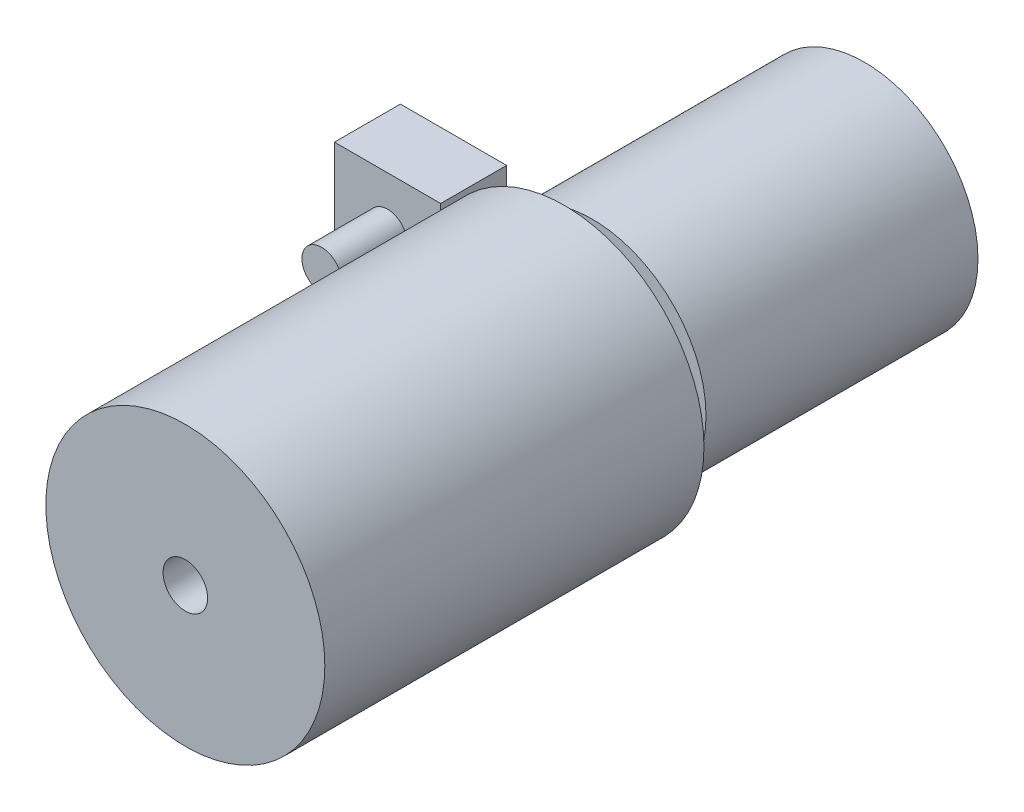
ISO-10303-21;
HEADER;
FILE_DESCRIPTION(('STEP AP214'),'2;1');
FILE_NAME('part.step','',(''),(''),'','','');
FILE_SCHEMA(('AUTOMOTIVE_DESIGN { 1 0 10303 214 1 1 1 1 }'));
ENDSEC;
DATA;
#1=APPLICATION_CONTEXT('core data for automotive mechanical design processes');
#2=APPLICATION_PROTOCOL_DEFINITION('international standard','automotive_design',2000,#1);
#3=PRODUCT_CONTEXT('',#1,'mechanical');
#4=PRODUCT('Part','Part','',(#3));
#5=PRODUCT_RELATED_PRODUCT_CATEGORY('part','',(#4));
#6=PRODUCT_DEFINITION_FORMATION('','',#4);
#7=PRODUCT_DEFINITION_CONTEXT('part definition',#1,'design');
#8=PRODUCT_DEFINITION('design','',#6,#7);
#9=PRODUCT_DEFINITION_SHAPE('','',#8);
#10=(LENGTH_UNIT() NAMED_UNIT(*) SI_UNIT(.MILLI.,.METRE.));
#11=(NAMED_UNIT(*) PLANE_ANGLE_UNIT() SI_UNIT($,.RADIAN.));
#12=(NAMED_UNIT(*) SI_UNIT($,.STERADIAN.) SOLID_ANGLE_UNIT());
#13=UNCERTAINTY_MEASURE_WITH_UNIT(LENGTH_MEASURE(1.E-05),#10,'distance_accuracy_value','');
#14=(GEOMETRIC_REPRESENTATION_CONTEXT(3) GLOBAL_UNCERTAINTY_ASSIGNED_CONTEXT((#13)) GLOBAL_UNIT_ASSIGNED_CONTEXT((#10,
#11,#12)) REPRESENTATION_CONTEXT('',''));
#15=CARTESIAN_POINT('',(0.,0.,0.));
#16=DIRECTION('',(0.,0.,1.));
#17=DIRECTION('',(1.,0.,0.));
#18=AXIS2_PLACEMENT_3D('',#15,#16,#17);
#19=CARTESIAN_POINT('',(0.,0.,82.4011594679737));
#20=DIRECTION('',(0.,0.,1.));
#21=DIRECTION('',(1.,0.,0.));
#22=AXIS2_PLACEMENT_3D('',#19,#20,#21);
#23=PLANE('',#22);
#24=CARTESIAN_POINT('',(0.,0.,82.4011594679737));
#25=DIRECTION('',(0.,0.,1.));
#26=DIRECTION('',(1.,0.,0.));
#27=AXIS2_PLACEMENT_3D('',#24,#25,#26);
#28=CIRCLE('',#27,16.9246045699818);
#29=CARTESIAN_POINT('',(16.9246045699818,0.,82.4011594679737));
#30=VERTEX_POINT('',#29);
#31=EDGE_CURVE('E12',#30,#30,#28,.T.);
#32=ORIENTED_EDGE('',*,*,#31,.T.);
#33=EDGE_LOOP('',(#32));
#34=FACE_BOUND('',#33,.T.);
#35=CARTESIAN_POINT('',(0.,0.,82.4011594679737));
#36=DIRECTION('',(0.,0.,1.));
#37=DIRECTION('',(1.,0.,0.));
#38=AXIS2_PLACEMENT_3D('',#35,#36,#37);
#39=CIRCLE('',#38,2.7046062);
#40=CARTESIAN_POINT('',(2.7046062,0.,82.4011594679737));
#41=VERTEX_POINT('',#40);
#42=EDGE_CURVE('E65',#41,#41,#39,.T.);
#43=ORIENTED_EDGE('',*,*,#42,.F.);
#44=EDGE_LOOP('',(#43));
#45=FACE_BOUND('',#44,.T.);
#46=ADVANCED_FACE('F54',(#34,#45),#23,.T.);
#47=CARTESIAN_POINT('',(0.,0.,36.4011594679737));
#48=DIRECTION('',(0.,0.,1.));
#49=DIRECTION('',(1.,0.,0.));
#50=AXIS2_PLACEMENT_3D('',#47,#48,#49);
#51=PLANE('',#50);
#52=CARTESIAN_POINT('',(0.,0.,36.4011594679737));
#53=DIRECTION('',(0.,0.,1.));
#54=DIRECTION('',(1.,0.,0.));
#55=AXIS2_PLACEMENT_3D('',#52,#53,#54);
#56=CIRCLE('',#55,16.9246045699818);
#57=CARTESIAN_POINT('',(16.9246045699818,0.,36.4011594679737));
#58=VERTEX_POINT('',#57);
#59=EDGE_CURVE('E58',#58,#58,#56,.T.);
#60=ORIENTED_EDGE('',*,*,#59,.F.);
#61=EDGE_LOOP('',(#60));
#62=FACE_BOUND('',#61,.T.);
#63=CARTESIAN_POINT('',(0.,0.,36.4011594679737));
#64=DIRECTION('',(0.,0.,1.));
#65=DIRECTION('',(1.,0.,0.));
#66=AXIS2_PLACEMENT_3D('',#63,#64,#65);
#67=CIRCLE('',#66,2.7046062);
#68=CARTESIAN_POINT('',(2.7046062,0.,36.4011594679737));
#69=VERTEX_POINT('',#68);
#70=EDGE_CURVE('E67',#69,#69,#67,.T.);
#71=ORIENTED_EDGE('',*,*,#70,.T.);
#72=EDGE_LOOP('',(#71));
#73=FACE_BOUND('',#72,.T.);
#74=ADVANCED_FACE('F77',(#62,#73),#51,.F.);
#75=CARTESIAN_POINT('',(0.,0.,82.4011594679737));
#76=DIRECTION('',(0.,0.,-1.));
#77=DIRECTION('',(-1.,0.,0.));
#78=AXIS2_PLACEMENT_3D('',#75,#76,#77);
#79=CYLINDRICAL_SURFACE('',#78,16.9246045699818);
#80=ORIENTED_EDGE('',*,*,#31,.F.);
#81=EDGE_LOOP('',(#80));
#82=FACE_BOUND('',#81,.T.);
#83=ORIENTED_EDGE('',*,*,#59,.T.);
#84=EDGE_LOOP('',(#83));
#85=FACE_BOUND('',#84,.T.);
#86=ADVANCED_FACE('F56',(#82,#85),#79,.T.);
#87=CARTESIAN_POINT('',(0.,0.,82.4011594679737));
#88=DIRECTION('',(0.,0.,-1.));
#89=DIRECTION('',(-1.,0.,0.));
#90=AXIS2_PLACEMENT_3D('',#87,#88,#89);
#91=CYLINDRICAL_SURFACE('',#90,2.7046062);
#92=ORIENTED_EDGE('',*,*,#42,.T.);
#93=EDGE_LOOP('',(#92));
#94=FACE_BOUND('',#93,.T.);
#95=ORIENTED_EDGE('',*,*,#70,.F.);
#96=EDGE_LOOP('',(#95));
#97=FACE_BOUND('',#96,.T.);
#98=ADVANCED_FACE('F73',(#94,#97),#91,.F.);
#99=CLOSED_SHELL('',(#46,#74,#86,#98));
#100=MANIFOLD_SOLID_BREP('B2',#99);
#101=CARTESIAN_POINT('',(-24.8647244854965,0.,41.));
#102=DIRECTION('',(0.,0.,-1.));
#103=DIRECTION('',(-1.,0.,0.));
#104=AXIS2_PLACEMENT_3D('',#101,#102,#103);
#105=CYLINDRICAL_SURFACE('',#104,2.39175593570654);
#106=CARTESIAN_POINT('',(-24.8647244854965,0.,41.));
#107=DIRECTION('',(0.,0.,1.));
#108=DIRECTION('',(1.,0.,0.));
#109=AXIS2_PLACEMENT_3D('',#106,#107,#108);
#110=CIRCLE('',#109,2.39175593570654);
#111=CARTESIAN_POINT('',(-22.4729685497899,0.,41.));
#112=VERTEX_POINT('',#111);
#113=EDGE_CURVE('E52',#112,#112,#110,.T.);
#114=ORIENTED_EDGE('',*,*,#113,.F.);
#115=EDGE_LOOP('',(#114));
#116=FACE_BOUND('',#115,.T.);
#117=CARTESIAN_POINT('',(-24.8647244854965,0.,33.));
#118=DIRECTION('',(0.,0.,1.));
#119=DIRECTION('',(1.,0.,0.));
#120=AXIS2_PLACEMENT_3D('',#117,#118,#119);
#121=CIRCLE('',#120,2.39175593570654);
#122=CARTESIAN_POINT('',(-22.4729685497899,0.,33.));
#123=VERTEX_POINT('',#122);
#124=EDGE_CURVE('E126',#123,#123,#121,.T.);
#125=ORIENTED_EDGE('',*,*,#124,.T.);
#126=EDGE_LOOP('',(#125));
#127=FACE_BOUND('',#126,.T.);
#128=ADVANCED_FACE('F123',(#116,#127),#105,.T.);
#129=CARTESIAN_POINT('',(0.,0.,41.));
#130=DIRECTION('',(0.,0.,1.));
#131=DIRECTION('',(1.,0.,0.));
#132=AXIS2_PLACEMENT_3D('',#129,#130,#131);
#133=PLANE('',#132);
#134=ORIENTED_EDGE('',*,*,#113,.T.);
#135=EDGE_LOOP('',(#134));
#136=FACE_BOUND('',#135,.T.);
#137=ADVANCED_FACE('F219',(#136),#133,.T.);
#138=CARTESIAN_POINT('',(-31.3070832551148,-6.21381259878717,25.));
#139=DIRECTION('',(1.,0.,0.));
#140=DIRECTION('',(0.,0.,-1.));
#141=AXIS2_PLACEMENT_3D('',#138,#139,#140);
#142=PLANE('',#141);
#143=DIRECTION('',(0.,1.,0.));
#144=VECTOR('',#143,1.);
#145=CARTESIAN_POINT('',(-31.3070832551148,-6.21381259878717,33.));
#146=LINE('',#145,#144);
#147=CARTESIAN_POINT('',(-31.3070832551148,-6.21381259878717,33.));
#148=VERTEX_POINT('',#147);
#149=CARTESIAN_POINT('',(-31.3070832551148,6.21381259878717,33.));
#150=VERTEX_POINT('',#149);
#151=EDGE_CURVE('E190',#148,#150,#146,.T.);
#152=ORIENTED_EDGE('',*,*,#151,.T.);
#153=DIRECTION('',(0.,0.,1.));
#154=VECTOR('',#153,1.);
#155=CARTESIAN_POINT('',(-31.3070832551148,6.21381259878717,25.));
#156=LINE('',#155,#154);
#157=CARTESIAN_POINT('',(-31.3070832551148,6.21381259878717,25.));
#158=VERTEX_POINT('',#157);
#159=EDGE_CURVE('E181',#158,#150,#156,.T.);
#160=ORIENTED_EDGE('',*,*,#159,.F.);
#161=DIRECTION('',(0.,1.,0.));
#162=VECTOR('',#161,1.);
#163=CARTESIAN_POINT('',(-31.3070832551148,-6.21381259878717,25.));
#164=LINE('',#163,#162);
#165=CARTESIAN_POINT('',(-31.3070832551148,-6.21381259878717,25.));
#166=VERTEX_POINT('',#165);
#167=EDGE_CURVE('E175',#166,#158,#164,.T.);
#168=ORIENTED_EDGE('',*,*,#167,.F.);
#169=DIRECTION('',(0.,0.,1.));
#170=VECTOR('',#169,1.);
#171=CARTESIAN_POINT('',(-31.3070832551148,-6.21381259878717,25.));
#172=LINE('',#171,#170);
#173=EDGE_CURVE('E186',#166,#148,#172,.T.);
#174=ORIENTED_EDGE('',*,*,#173,.T.);
#175=EDGE_LOOP('',(#152,#160,#168,#174));
#176=FACE_BOUND('',#175,.T.);
#177=ADVANCED_FACE('F208',(#176),#142,.F.);
#178=CARTESIAN_POINT('',(-18.4223657158782,6.21381259878717,25.));
#179=DIRECTION('',(0.,-1.,0.));
#180=DIRECTION('',(0.,0.,-1.));
#181=AXIS2_PLACEMENT_3D('',#178,#179,#180);
#182=PLANE('',#181);
#183=DIRECTION('',(1.,0.,0.));
#184=VECTOR('',#183,1.);
#185=CARTESIAN_POINT('',(-18.4223657158782,6.21381259878717,33.));
#186=LINE('',#185,#184);
#187=CARTESIAN_POINT('',(-18.4223657158782,6.21381259878717,33.));
#188=VERTEX_POINT('',#187);
#189=EDGE_CURVE('E180',#150,#188,#186,.T.);
#190=ORIENTED_EDGE('',*,*,#189,.T.);
#191=DIRECTION('',(0.,0.,1.));
#192=VECTOR('',#191,1.);
#193=CARTESIAN_POINT('',(-18.4223657158782,6.21381259878717,25.));
#194=LINE('',#193,#192);
#195=CARTESIAN_POINT('',(-18.4223657158782,6.21381259878717,25.));
#196=VERTEX_POINT('',#195);
#197=EDGE_CURVE('E178',#196,#188,#194,.T.);
#198=ORIENTED_EDGE('',*,*,#197,.F.);
#199=DIRECTION('',(1.,0.,0.));
#200=VECTOR('',#199,1.);
#201=CARTESIAN_POINT('',(-18.4223657158782,6.21381259878717,25.));
#202=LINE('',#201,#200);
#203=EDGE_CURVE('E170',#158,#196,#202,.T.);
#204=ORIENTED_EDGE('',*,*,#203,.F.);
#205=ORIENTED_EDGE('',*,*,#159,.T.);
#206=EDGE_LOOP('',(#190,#198,#204,#205));
#207=FACE_BOUND('',#206,.T.);
#208=ADVANCED_FACE('F179',(#207),#182,.F.);
#209=CARTESIAN_POINT('',(-18.4223657158782,-6.21381259878717,25.));
#210=DIRECTION('',(-1.,0.,0.));
#211=DIRECTION('',(0.,0.,1.));
#212=AXIS2_PLACEMENT_3D('',#209,#210,#211);
#213=PLANE('',#212);
#214=DIRECTION('',(0.,-1.,0.));
#215=VECTOR('',#214,1.);
#216=CARTESIAN_POINT('',(-18.4223657158782,-6.21381259878717,33.));
#217=LINE('',#216,#215);
#218=CARTESIAN_POINT('',(-18.4223657158782,-6.21381259878717,33.));
#219=VERTEX_POINT('',#218);
#220=EDGE_CURVE('E156',#188,#219,#217,.T.);
#221=ORIENTED_EDGE('',*,*,#220,.T.);
#222=DIRECTION('',(0.,0.,1.));
#223=VECTOR('',#222,1.);
#224=CARTESIAN_POINT('',(-18.4223657158782,-6.21381259878717,25.));
#225=LINE('',#224,#223);
#226=CARTESIAN_POINT('',(-18.4223657158782,-6.21381259878717,25.));
#227=VERTEX_POINT('',#226);
#228=EDGE_CURVE('E182',#227,#219,#225,.T.);
#229=ORIENTED_EDGE('',*,*,#228,.F.);
#230=DIRECTION('',(0.,-1.,0.));
#231=VECTOR('',#230,1.);
#232=CARTESIAN_POINT('',(-18.4223657158782,-6.21381259878717,25.));
#233=LINE('',#232,#231);
#234=EDGE_CURVE('E173',#196,#227,#233,.T.);
#235=ORIENTED_EDGE('',*,*,#234,.F.);
#236=ORIENTED_EDGE('',*,*,#197,.T.);
#237=EDGE_LOOP('',(#221,#229,#235,#236));
#238=FACE_BOUND('',#237,.T.);
#239=ADVANCED_FACE('F184',(#238),#213,.F.);
#240=CARTESIAN_POINT('',(-18.4223657158782,-6.21381259878717,25.));
#241=DIRECTION('',(0.,1.,0.));
#242=DIRECTION('',(0.,0.,1.));
#243=AXIS2_PLACEMENT_3D('',#240,#241,#242);
#244=PLANE('',#243);
#245=DIRECTION('',(-1.,0.,0.));
#246=VECTOR('',#245,1.);
#247=CARTESIAN_POINT('',(-18.4223657158782,-6.21381259878717,33.));
#248=LINE('',#247,#246);
#249=EDGE_CURVE('E162',#219,#148,#248,.T.);
#250=ORIENTED_EDGE('',*,*,#249,.T.);
#251=ORIENTED_EDGE('',*,*,#173,.F.);
#252=DIRECTION('',(-1.,0.,0.));
#253=VECTOR('',#252,1.);
#254=CARTESIAN_POINT('',(-18.4223657158782,-6.21381259878717,25.));
#255=LINE('',#254,#253);
#256=EDGE_CURVE('E139',#227,#166,#255,.T.);
#257=ORIENTED_EDGE('',*,*,#256,.F.);
#258=ORIENTED_EDGE('',*,*,#228,.T.);
#259=EDGE_LOOP('',(#250,#251,#257,#258));
#260=FACE_BOUND('',#259,.T.);
#261=ADVANCED_FACE('F209',(#260),#244,.F.);
#262=CARTESIAN_POINT('',(0.,0.,25.));
#263=DIRECTION('',(0.,0.,1.));
#264=DIRECTION('',(1.,0.,0.));
#265=AXIS2_PLACEMENT_3D('',#262,#263,#264);
#266=PLANE('',#265);
#267=ORIENTED_EDGE('',*,*,#167,.T.);
#268=ORIENTED_EDGE('',*,*,#203,.T.);
#269=ORIENTED_EDGE('',*,*,#234,.T.);
#270=ORIENTED_EDGE('',*,*,#256,.T.);
#271=EDGE_LOOP('',(#267,#268,#269,#270));
#272=FACE_BOUND('',#271,.T.);
#273=ADVANCED_FACE('F171',(#272),#266,.F.);
#274=CARTESIAN_POINT('',(0.,0.,33.));
#275=DIRECTION('',(0.,0.,1.));
#276=DIRECTION('',(1.,0.,0.));
#277=AXIS2_PLACEMENT_3D('',#274,#275,#276);
#278=PLANE('',#277);
#279=ORIENTED_EDGE('',*,*,#124,.F.);
#280=EDGE_LOOP('',(#279));
#281=FACE_BOUND('',#280,.T.);
#282=ORIENTED_EDGE('',*,*,#151,.F.);
#283=ORIENTED_EDGE('',*,*,#249,.F.);
#284=ORIENTED_EDGE('',*,*,#220,.F.);
#285=ORIENTED_EDGE('',*,*,#189,.F.);
#286=EDGE_LOOP('',(#282,#283,#284,#285));
#287=FACE_BOUND('',#286,.T.);
#288=ADVANCED_FACE('F202',(#281,#287),#278,.T.);
#289=CLOSED_SHELL('',(#128,#137,#177,#208,#239,#261,#273,#288));
#290=MANIFOLD_SOLID_BREP('B7',#289);
#291=CARTESIAN_POINT('',(0.,0.,33.));
#292=DIRECTION('',(0.,0.,-1.));
#293=DIRECTION('',(-1.,0.,0.));
#294=AXIS2_PLACEMENT_3D('',#291,#292,#293);
#295=CYLINDRICAL_SURFACE('',#294,13.7713116662806);
#296=CARTESIAN_POINT('',(0.,0.,33.));
#297=DIRECTION('',(0.,0.,1.));
#298=DIRECTION('',(1.,0.,0.));
#299=AXIS2_PLACEMENT_3D('',#296,#297,#298);
#300=CIRCLE('',#299,13.7713116662806);
#301=CARTESIAN_POINT('',(13.7713116662806,0.,33.));
#302=VERTEX_POINT('',#301);
#303=EDGE_CURVE('E284',#302,#302,#300,.T.);
#304=ORIENTED_EDGE('',*,*,#303,.F.);
#305=EDGE_LOOP('',(#304));
#306=FACE_BOUND('',#305,.T.);
#307=CARTESIAN_POINT('',(0.,0.,0.));
#308=DIRECTION('',(0.,0.,1.));
#309=DIRECTION('',(1.,0.,0.));
#310=AXIS2_PLACEMENT_3D('',#307,#308,#309);
#311=CIRCLE('',#310,13.7713116662806);
#312=CARTESIAN_POINT('',(13.7713116662806,0.,0.));
#313=VERTEX_POINT('',#312);
#314=EDGE_CURVE('E280',#313,#313,#311,.T.);
#315=ORIENTED_EDGE('',*,*,#314,.T.);
#316=EDGE_LOOP('',(#315));
#317=FACE_BOUND('',#316,.T.);
#318=ADVANCED_FACE('F277',(#306,#317),#295,.T.);
#319=CARTESIAN_POINT('',(0.,0.,33.));
#320=DIRECTION('',(0.,0.,1.));
#321=DIRECTION('',(1.,0.,0.));
#322=AXIS2_PLACEMENT_3D('',#319,#320,#321);
#323=PLANE('',#322);
#324=CARTESIAN_POINT('',(0.,0.,33.));
#325=DIRECTION('',(0.,0.,1.));
#326=DIRECTION('',(1.,0.,0.));
#327=AXIS2_PLACEMENT_3D('',#324,#325,#326);
#328=CIRCLE('',#327,2.67046061904313);
#329=CARTESIAN_POINT('',(2.67046061904313,0.,33.));
#330=VERTEX_POINT('',#329);
#331=EDGE_CURVE('E122',#330,#330,#328,.T.);
#332=ORIENTED_EDGE('',*,*,#331,.F.);
#333=EDGE_LOOP('',(#332));
#334=FACE_BOUND('',#333,.T.);
#335=ORIENTED_EDGE('',*,*,#303,.T.);
#336=EDGE_LOOP('',(#335));
#337=FACE_BOUND('',#336,.T.);
#338=ADVANCED_FACE('F301',(#334,#337),#323,.T.);
#339=CARTESIAN_POINT('',(0.,0.,0.));
#340=DIRECTION('',(0.,0.,1.));
#341=DIRECTION('',(1.,0.,0.));
#342=AXIS2_PLACEMENT_3D('',#339,#340,#341);
#343=PLANE('',#342);
#344=ORIENTED_EDGE('',*,*,#314,.F.);
#345=EDGE_LOOP('',(#344));
#346=FACE_BOUND('',#345,.T.);
#347=ADVANCED_FACE('F298',(#346),#343,.F.);
#348=CARTESIAN_POINT('',(0.,0.,36.4011594679737));
#349=DIRECTION('',(0.,0.,-1.));
#350=DIRECTION('',(-1.,0.,0.));
#351=AXIS2_PLACEMENT_3D('',#348,#349,#350);
#352=CYLINDRICAL_SURFACE('',#351,2.67046061904313);
#353=CARTESIAN_POINT('',(0.,0.,36.4011594679737));
#354=DIRECTION('',(0.,0.,1.));
#355=DIRECTION('',(1.,0.,0.));
#356=AXIS2_PLACEMENT_3D('',#353,#354,#355);
#357=CIRCLE('',#356,2.67046061904313);
#358=CARTESIAN_POINT('',(2.67046061904313,0.,36.4011594679737));
#359=VERTEX_POINT('',#358);
#360=EDGE_CURVE('E290',#359,#359,#357,.T.);
#361=ORIENTED_EDGE('',*,*,#360,.F.);
#362=EDGE_LOOP('',(#361));
#363=FACE_BOUND('',#362,.T.);
#364=ORIENTED_EDGE('',*,*,#331,.T.);
#365=EDGE_LOOP('',(#364));
#366=FACE_BOUND('',#365,.T.);
#367=ADVANCED_FACE('F300',(#363,#366),#352,.T.);
#368=CARTESIAN_POINT('',(0.,0.,36.4011594679737));
#369=DIRECTION('',(0.,0.,1.));
#370=DIRECTION('',(1.,0.,0.));
#371=AXIS2_PLACEMENT_3D('',#368,#369,#370);
#372=PLANE('',#371);
#373=ORIENTED_EDGE('',*,*,#360,.T.);
#374=EDGE_LOOP('',(#373));
#375=FACE_BOUND('',#374,.T.);
#376=ADVANCED_FACE('F306',(#375),#372,.T.);
#377=CLOSED_SHELL('',(#318,#338,#347,#367,#376));
#378=MANIFOLD_SOLID_BREP('B46',#377);
#379=ADVANCED_BREP_SHAPE_REPRESENTATION('',(#18,#100,#290,#378),#14);
#380=SHAPE_DEFINITION_REPRESENTATION(#9,#379);
ENDSEC;
END-ISO-10303-21;
